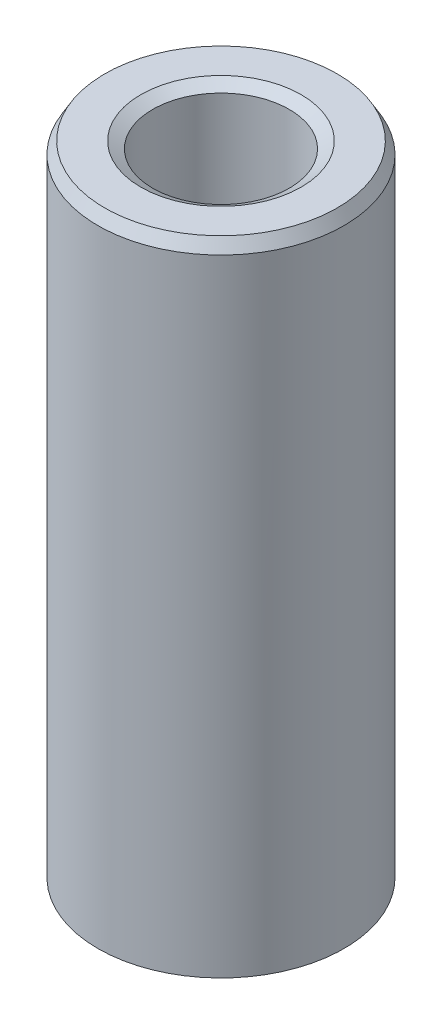
ISO-10303-21;
HEADER;
FILE_DESCRIPTION(('STEP AP214'),'2;1');
FILE_NAME('part.step','',(''),(''),'','','');
FILE_SCHEMA(('AUTOMOTIVE_DESIGN { 1 0 10303 214 1 1 1 1 }'));
ENDSEC;
DATA;
#1=APPLICATION_CONTEXT('core data for automotive mechanical design processes');
#2=APPLICATION_PROTOCOL_DEFINITION('international standard','automotive_design',2000,#1);
#3=PRODUCT_CONTEXT('',#1,'mechanical');
#4=PRODUCT('Part','Part','',(#3));
#5=PRODUCT_RELATED_PRODUCT_CATEGORY('part','',(#4));
#6=PRODUCT_DEFINITION_FORMATION('','',#4);
#7=PRODUCT_DEFINITION_CONTEXT('part definition',#1,'design');
#8=PRODUCT_DEFINITION('design','',#6,#7);
#9=PRODUCT_DEFINITION_SHAPE('','',#8);
#10=(LENGTH_UNIT() NAMED_UNIT(*) SI_UNIT(.MILLI.,.METRE.));
#11=(NAMED_UNIT(*) PLANE_ANGLE_UNIT() SI_UNIT($,.RADIAN.));
#12=(NAMED_UNIT(*) SI_UNIT($,.STERADIAN.) SOLID_ANGLE_UNIT());
#13=UNCERTAINTY_MEASURE_WITH_UNIT(LENGTH_MEASURE(1.E-05),#10,'distance_accuracy_value','');
#14=(GEOMETRIC_REPRESENTATION_CONTEXT(3) GLOBAL_UNCERTAINTY_ASSIGNED_CONTEXT((#13)) GLOBAL_UNIT_ASSIGNED_CONTEXT((#10,
#11,#12)) REPRESENTATION_CONTEXT('',''));
#15=CARTESIAN_POINT('',(0.,0.,0.));
#16=DIRECTION('',(0.,0.,1.));
#17=DIRECTION('',(1.,0.,0.));
#18=AXIS2_PLACEMENT_3D('',#15,#16,#17);
#19=CARTESIAN_POINT('',(0.,39.2922602206533,0.));
#20=DIRECTION('',(0.,-1.,0.));
#21=DIRECTION('',(0.,0.,-1.));
#22=AXIS2_PLACEMENT_3D('',#19,#20,#21);
#23=CYLINDRICAL_SURFACE('',#22,7.5);
#24=CARTESIAN_POINT('',(0.,0.417417148929108,0.));
#25=DIRECTION('',(0.,1.,0.));
#26=DIRECTION('',(0.,0.,1.));
#27=AXIS2_PLACEMENT_3D('',#24,#25,#26);
#28=CIRCLE('',#27,7.5);
#29=CARTESIAN_POINT('',(0.,0.417417148929108,-7.5));
#30=VERTEX_POINT('',#29);
#31=EDGE_CURVE('E10',#30,#30,#28,.T.);
#32=CARTESIAN_POINT('',(0.,38.5692725107575,0.));
#33=DIRECTION('',(0.,1.,0.));
#34=DIRECTION('',(0.,0.,1.));
#35=AXIS2_PLACEMENT_3D('',#32,#33,#34);
#36=CIRCLE('',#35,7.5);
#37=CARTESIAN_POINT('',(0.,38.5692725107575,-7.5));
#38=VERTEX_POINT('',#37);
#39=EDGE_CURVE('E50',#38,#38,#36,.F.);
#40=CARTESIAN_POINT('',(0.,0.417417148929108,-7.5));
#41=CARTESIAN_POINT('',(0.,0.814832308948156,-7.5));
#42=CARTESIAN_POINT('',(0.,1.2122474689672,-7.5));
#43=CARTESIAN_POINT('',(0.,2.00707778900529,-7.5));
#44=CARTESIAN_POINT('',(0.,2.40449294902434,-7.5));
#45=CARTESIAN_POINT('',(0.,3.19932326906243,-7.5));
#46=CARTESIAN_POINT('',(0.,3.59673842908147,-7.5));
#47=CARTESIAN_POINT('',(0.,4.39156874911957,-7.5));
#48=CARTESIAN_POINT('',(0.,4.78898390913861,-7.5));
#49=CARTESIAN_POINT('',(0.,5.58381422917671,-7.5));
#50=CARTESIAN_POINT('',(0.,5.98122938919575,-7.5));
#51=CARTESIAN_POINT('',(0.,6.77605970923385,-7.5));
#52=CARTESIAN_POINT('',(0.,7.17347486925289,-7.5));
#53=CARTESIAN_POINT('',(0.,7.96830518929098,-7.5));
#54=CARTESIAN_POINT('',(0.,8.36572034931003,-7.5));
#55=CARTESIAN_POINT('',(0.,9.16055066934812,-7.5));
#56=CARTESIAN_POINT('',(0.,9.55796582936716,-7.5));
#57=CARTESIAN_POINT('',(0.,10.3527961494053,-7.5));
#58=CARTESIAN_POINT('',(0.,10.7502113094243,-7.5));
#59=CARTESIAN_POINT('',(0.,11.5450416294624,-7.5));
#60=CARTESIAN_POINT('',(0.,11.9424567894814,-7.5));
#61=CARTESIAN_POINT('',(0.,12.7372871095195,-7.5));
#62=CARTESIAN_POINT('',(0.,13.1347022695386,-7.5));
#63=CARTESIAN_POINT('',(0.,13.9295325895767,-7.5));
#64=CARTESIAN_POINT('',(0.,14.3269477495957,-7.5));
#65=CARTESIAN_POINT('',(0.,15.1217780696338,-7.5));
#66=CARTESIAN_POINT('',(0.,15.5191932296529,-7.5));
#67=CARTESIAN_POINT('',(0.,16.3140235496909,-7.5));
#68=CARTESIAN_POINT('',(0.,16.71143870971,-7.5));
#69=CARTESIAN_POINT('',(0.,17.5062690297481,-7.5));
#70=CARTESIAN_POINT('',(0.,17.9036841897671,-7.5));
#71=CARTESIAN_POINT('',(0.,18.6985145098052,-7.5));
#72=CARTESIAN_POINT('',(0.,19.0959296698243,-7.5));
#73=CARTESIAN_POINT('',(0.,19.8907599898624,-7.5));
#74=CARTESIAN_POINT('',(0.,20.2881751498814,-7.5));
#75=CARTESIAN_POINT('',(0.,21.0830054699195,-7.5));
#76=CARTESIAN_POINT('',(0.,21.4804206299385,-7.5));
#77=CARTESIAN_POINT('',(0.,22.2752509499766,-7.5));
#78=CARTESIAN_POINT('',(0.,22.6726661099957,-7.5));
#79=CARTESIAN_POINT('',(0.,23.4674964300338,-7.5));
#80=CARTESIAN_POINT('',(0.,23.8649115900528,-7.5));
#81=CARTESIAN_POINT('',(0.,24.6597419100909,-7.5));
#82=CARTESIAN_POINT('',(0.,25.05715707011,-7.5));
#83=CARTESIAN_POINT('',(0.,25.8519873901481,-7.5));
#84=CARTESIAN_POINT('',(0.,26.2494025501671,-7.5));
#85=CARTESIAN_POINT('',(0.,27.0442328702052,-7.5));
#86=CARTESIAN_POINT('',(0.,27.4416480302242,-7.5));
#87=CARTESIAN_POINT('',(0.,28.2364783502623,-7.5));
#88=CARTESIAN_POINT('',(0.,28.6338935102814,-7.5));
#89=CARTESIAN_POINT('',(0.,29.4287238303195,-7.5));
#90=CARTESIAN_POINT('',(0.,29.8261389903385,-7.5));
#91=CARTESIAN_POINT('',(0.,30.6209693103766,-7.5));
#92=CARTESIAN_POINT('',(0.,31.0183844703956,-7.5));
#93=CARTESIAN_POINT('',(0.,31.8132147904337,-7.5));
#94=CARTESIAN_POINT('',(0.,32.2106299504528,-7.5));
#95=CARTESIAN_POINT('',(0.,33.0054602704909,-7.5));
#96=CARTESIAN_POINT('',(0.,33.4028754305099,-7.5));
#97=CARTESIAN_POINT('',(0.,34.197705750548,-7.5));
#98=CARTESIAN_POINT('',(0.,34.5951209105671,-7.5));
#99=CARTESIAN_POINT('',(0.,35.3899512306052,-7.5));
#100=CARTESIAN_POINT('',(0.,35.7873663906242,-7.5));
#101=CARTESIAN_POINT('',(0.,36.5821967106623,-7.5));
#102=CARTESIAN_POINT('',(0.,36.9796118706813,-7.5));
#103=CARTESIAN_POINT('',(0.,37.7744421907194,-7.5));
#104=CARTESIAN_POINT('',(0.,38.1718573507385,-7.5));
#105=CARTESIAN_POINT('',(0.,38.5692725107575,-7.5));
#106=B_SPLINE_CURVE_WITH_KNOTS('',3,(#40,#41,#42,#43,#44,#45,#46,#47,#48,#49,#50,#51,#52,#53,
#54,#55,#56,#57,#58,#59,#60,#61,#62,#63,#64,#65,#66,#67,#68,#69,#70,#71,#72,#73,#74,#75,#76,#77,
#78,#79,#80,#81,#82,#83,#84,#85,#86,#87,#88,#89,#90,#91,#92,#93,#94,#95,#96,#97,#98,#99,#100,
#101,#102,#103,#104,#105),.UNSPECIFIED.,.F.,.F.,(4,2,2,2,2,2,2,2,2,2,2,2,2,2,2,2,2,2,2,2,2,2,2,
2,2,2,2,2,2,2,2,2,4),(0.,1.19224548005714,2.38449096011428,3.57673644017141,4.76898192022855,
5.96122740028569,7.15347288034283,8.34571836039997,9.5379638404571,10.7302093205142,
11.9224548005714,13.1147002806285,14.3069457606857,15.4991912407428,16.6914367207999,
17.8836822008571,19.0759276809142,20.2681731609713,21.4604186410285,22.6526641210856,
23.8449096011428,25.0371550811999,26.229400561257,27.4216460413142,28.6138915213713,
29.8061370014284,30.9983824814856,32.1906279615427,33.3828734415999,34.575118921657,
35.7673644017141,36.9596098817713,38.1518553618284),.UNSPECIFIED.);
#107=EDGE_CURVE('BSEAM39',#30,#38,#106,.T.);
#108=ORIENTED_EDGE('',*,*,#31,.T.);
#109=ORIENTED_EDGE('',*,*,#39,.T.);
#110=ORIENTED_EDGE('',*,*,#107,.T.);
#111=ORIENTED_EDGE('',*,*,#107,.F.);
#112=EDGE_LOOP('',(#108,#110,#109,#111));
#113=FACE_BOUND('',#112,.T.);
#114=ADVANCED_FACE('F39',(#113),#23,.T.);
#115=CARTESIAN_POINT('',(0.,39.2922602206533,0.));
#116=DIRECTION('',(0.,1.,0.));
#117=DIRECTION('',(0.,0.,1.));
#118=AXIS2_PLACEMENT_3D('',#115,#116,#117);
#119=PLANE('',#118);
#120=CARTESIAN_POINT('',(0.,39.2922602206533,0.));
#121=DIRECTION('',(0.,1.,0.));
#122=DIRECTION('',(0.,0.,1.));
#123=AXIS2_PLACEMENT_3D('',#120,#121,#122);
#124=CIRCLE('',#123,4.88631858253508);
#125=CARTESIAN_POINT('',(0.,39.2922602206533,4.88631858253508));
#126=VERTEX_POINT('',#125);
#127=EDGE_CURVE('E58',#126,#126,#124,.F.);
#128=ORIENTED_EDGE('',*,*,#127,.T.);
#129=EDGE_LOOP('',(#128));
#130=FACE_BOUND('',#129,.T.);
#131=CARTESIAN_POINT('',(0.,39.2922602206533,0.));
#132=DIRECTION('',(0.,1.,0.));
#133=DIRECTION('',(0.,0.,1.));
#134=AXIS2_PLACEMENT_3D('',#131,#132,#133);
#135=CIRCLE('',#134,7.0825828510709);
#136=CARTESIAN_POINT('',(0.,39.2922602206533,-7.0825828510709));
#137=VERTEX_POINT('',#136);
#138=EDGE_CURVE('E61',#137,#137,#135,.T.);
#139=ORIENTED_EDGE('',*,*,#138,.T.);
#140=EDGE_LOOP('',(#139));
#141=FACE_BOUND('',#140,.T.);
#142=ADVANCED_FACE('F88',(#130,#141),#119,.T.);
#143=CARTESIAN_POINT('',(0.,0.,0.));
#144=DIRECTION('',(0.,1.,0.));
#145=DIRECTION('',(0.,0.,1.));
#146=AXIS2_PLACEMENT_3D('',#143,#144,#145);
#147=PLANE('',#146);
#148=CARTESIAN_POINT('',(0.,0.,0.));
#149=DIRECTION('',(0.,1.,0.));
#150=DIRECTION('',(0.,0.,1.));
#151=AXIS2_PLACEMENT_3D('',#148,#149,#150);
#152=CIRCLE('',#151,4.58074802156842);
#153=CARTESIAN_POINT('',(0.,0.,4.58074802156842));
#154=VERTEX_POINT('',#153);
#155=EDGE_CURVE('E51',#154,#154,#152,.T.);
#156=ORIENTED_EDGE('',*,*,#155,.T.);
#157=EDGE_LOOP('',(#156));
#158=FACE_BOUND('',#157,.T.);
#159=CARTESIAN_POINT('',(0.,0.,0.));
#160=DIRECTION('',(0.,1.,0.));
#161=DIRECTION('',(0.,0.,1.));
#162=AXIS2_PLACEMENT_3D('',#159,#160,#161);
#163=CIRCLE('',#162,6.77701229010423);
#164=CARTESIAN_POINT('',(0.,0.,6.77701229010423));
#165=VERTEX_POINT('',#164);
#166=EDGE_CURVE('E54',#165,#165,#163,.F.);
#167=ORIENTED_EDGE('',*,*,#166,.T.);
#168=EDGE_LOOP('',(#167));
#169=FACE_BOUND('',#168,.T.);
#170=ADVANCED_FACE('F83',(#158,#169),#147,.F.);
#171=CARTESIAN_POINT('',(0.,39.2922602206533,0.));
#172=DIRECTION('',(0.,-1.,0.));
#173=DIRECTION('',(0.,0.,-1.));
#174=AXIS2_PLACEMENT_3D('',#171,#172,#173);
#175=CYLINDRICAL_SURFACE('',#174,4.16333087263931);
#176=CARTESIAN_POINT('',(0.,38.8748430717242,0.));
#177=DIRECTION('',(0.,1.,0.));
#178=DIRECTION('',(0.,0.,1.));
#179=AXIS2_PLACEMENT_3D('',#176,#177,#178);
#180=CIRCLE('',#179,4.16333087263931);
#181=CARTESIAN_POINT('',(0.,38.8748430717242,4.16333087263931));
#182=VERTEX_POINT('',#181);
#183=EDGE_CURVE('E67',#182,#182,#180,.T.);
#184=ORIENTED_EDGE('',*,*,#183,.T.);
#185=EDGE_LOOP('',(#184));
#186=FACE_BOUND('',#185,.T.);
#187=CARTESIAN_POINT('',(0.,0.722987709895768,0.));
#188=DIRECTION('',(0.,1.,0.));
#189=DIRECTION('',(0.,0.,1.));
#190=AXIS2_PLACEMENT_3D('',#187,#188,#189);
#191=CIRCLE('',#190,4.16333087263931);
#192=CARTESIAN_POINT('',(0.,0.722987709895768,4.16333087263931));
#193=VERTEX_POINT('',#192);
#194=EDGE_CURVE('E69',#193,#193,#191,.F.);
#195=ORIENTED_EDGE('',*,*,#194,.T.);
#196=EDGE_LOOP('',(#195));
#197=FACE_BOUND('',#196,.T.);
#198=ADVANCED_FACE('F71',(#186,#197),#175,.F.);
#199=CARTESIAN_POINT('',(0.,38.8748430717242,0.));
#200=DIRECTION('',(0.,1.,0.));
#201=DIRECTION('',(0.,0.,1.));
#202=AXIS2_PLACEMENT_3D('',#199,#200,#201);
#203=CONICAL_SURFACE('',#202,4.16333087263931,1.04719755119659);
#204=ORIENTED_EDGE('',*,*,#127,.F.);
#205=EDGE_LOOP('',(#204));
#206=FACE_BOUND('',#205,.T.);
#207=ORIENTED_EDGE('',*,*,#183,.F.);
#208=EDGE_LOOP('',(#207));
#209=FACE_BOUND('',#208,.T.);
#210=ADVANCED_FACE('F77',(#206,#209),#203,.F.);
#211=CARTESIAN_POINT('',(0.,0.,0.));
#212=DIRECTION('',(0.,-1.,0.));
#213=DIRECTION('',(0.,0.,-1.));
#214=AXIS2_PLACEMENT_3D('',#211,#212,#213);
#215=CONICAL_SURFACE('',#214,4.58074802156842,0.523598775598296);
#216=ORIENTED_EDGE('',*,*,#194,.F.);
#217=EDGE_LOOP('',(#216));
#218=FACE_BOUND('',#217,.T.);
#219=ORIENTED_EDGE('',*,*,#155,.F.);
#220=EDGE_LOOP('',(#219));
#221=FACE_BOUND('',#220,.T.);
#222=ADVANCED_FACE('F73',(#218,#221),#215,.F.);
#223=CARTESIAN_POINT('',(0.,0.417417148929108,0.));
#224=DIRECTION('',(0.,1.,0.));
#225=DIRECTION('',(0.,0.,1.));
#226=AXIS2_PLACEMENT_3D('',#223,#224,#225);
#227=CONICAL_SURFACE('',#226,7.5,1.0471975511966);
#228=ORIENTED_EDGE('',*,*,#166,.F.);
#229=EDGE_LOOP('',(#228));
#230=FACE_BOUND('',#229,.T.);
#231=ORIENTED_EDGE('',*,*,#31,.F.);
#232=EDGE_LOOP('',(#231));
#233=FACE_BOUND('',#232,.T.);
#234=ADVANCED_FACE('F76',(#230,#233),#227,.T.);
#235=CARTESIAN_POINT('',(0.,39.2922602206533,0.));
#236=DIRECTION('',(0.,-1.,0.));
#237=DIRECTION('',(0.,0.,-1.));
#238=AXIS2_PLACEMENT_3D('',#235,#236,#237);
#239=CONICAL_SURFACE('',#238,7.0825828510709,0.523598775598295);
#240=CARTESIAN_POINT('',(0.,38.5692725107575,-7.5));
#241=CARTESIAN_POINT('',(0.,38.5768036327356,-7.49565190469866));
#242=CARTESIAN_POINT('',(0.,38.5843347547137,-7.49130380939731));
#243=CARTESIAN_POINT('',(0.,38.5993969986698,-7.48260761879462));
#244=CARTESIAN_POINT('',(0.,38.6069281206479,-7.47825952349328));
#245=CARTESIAN_POINT('',(0.,38.6219903646041,-7.46956333289059));
#246=CARTESIAN_POINT('',(0.,38.6295214865822,-7.46521523758924));
#247=CARTESIAN_POINT('',(0.,38.6445837305383,-7.45651904698655));
#248=CARTESIAN_POINT('',(0.,38.6521148525164,-7.45217095168521));
#249=CARTESIAN_POINT('',(0.,38.6671770964726,-7.44347476108252));
#250=CARTESIAN_POINT('',(0.,38.6747082184507,-7.43912666578117));
#251=CARTESIAN_POINT('',(0.,38.6897704624068,-7.43043047517849));
#252=CARTESIAN_POINT('',(0.,38.6973015843849,-7.42608237987714));
#253=CARTESIAN_POINT('',(0.,38.7123638283411,-7.41738618927445));
#254=CARTESIAN_POINT('',(0.,38.7198949503191,-7.41303809397311));
#255=CARTESIAN_POINT('',(0.,38.7349571942753,-7.40434190337042));
#256=CARTESIAN_POINT('',(0.,38.7424883162534,-7.39999380806907));
#257=CARTESIAN_POINT('',(0.,38.7575505602095,-7.39129761746638));
#258=CARTESIAN_POINT('',(0.,38.7650816821876,-7.38694952216504));
#259=CARTESIAN_POINT('',(0.,38.7801439261438,-7.37825333156235));
#260=CARTESIAN_POINT('',(0.,38.7876750481219,-7.373905236261));
#261=CARTESIAN_POINT('',(0.,38.802737292078,-7.36520904565831));
#262=CARTESIAN_POINT('',(0.,38.8102684140561,-7.36086095035697));
#263=CARTESIAN_POINT('',(0.,38.8253306580123,-7.35216475975428));
#264=CARTESIAN_POINT('',(0.,38.8328617799904,-7.34781666445293));
#265=CARTESIAN_POINT('',(0.,38.8479240239465,-7.33912047385024));
#266=CARTESIAN_POINT('',(0.,38.8554551459246,-7.3347723785489));
#267=CARTESIAN_POINT('',(0.,38.8705173898808,-7.32607618794621));
#268=CARTESIAN_POINT('',(0.,38.8780485118588,-7.32172809264486));
#269=CARTESIAN_POINT('',(0.,38.893110755815,-7.31303190204218));
#270=CARTESIAN_POINT('',(0.,38.9006418777931,-7.30868380674083));
#271=CARTESIAN_POINT('',(0.,38.9157041217492,-7.29998761613814));
#272=CARTESIAN_POINT('',(0.,38.9232352437273,-7.2956395208368));
#273=CARTESIAN_POINT('',(0.,38.9382974876835,-7.28694333023411));
#274=CARTESIAN_POINT('',(0.,38.9458286096616,-7.28259523493276));
#275=CARTESIAN_POINT('',(0.,38.9608908536177,-7.27389904433007));
#276=CARTESIAN_POINT('',(0.,38.9684219755958,-7.26955094902873));
#277=CARTESIAN_POINT('',(0.,38.983484219552,-7.26085475842604));
#278=CARTESIAN_POINT('',(0.,38.9910153415301,-7.25650666312469));
#279=CARTESIAN_POINT('',(0.,39.0060775854862,-7.247810472522));
#280=CARTESIAN_POINT('',(0.,39.0136087074643,-7.24346237722066));
#281=CARTESIAN_POINT('',(0.,39.0286709514205,-7.23476618661797));
#282=CARTESIAN_POINT('',(0.,39.0362020733985,-7.23041809131662));
#283=CARTESIAN_POINT('',(0.,39.0512643173547,-7.22172190071393));
#284=CARTESIAN_POINT('',(0.,39.0587954393328,-7.21737380541259));
#285=CARTESIAN_POINT('',(0.,39.0738576832889,-7.2086776148099));
#286=CARTESIAN_POINT('',(0.,39.081388805267,-7.20432951950855));
#287=CARTESIAN_POINT('',(0.,39.0964510492232,-7.19563332890587));
#288=CARTESIAN_POINT('',(0.,39.1039821712013,-7.19128523360452));
#289=CARTESIAN_POINT('',(0.,39.1190444151574,-7.18258904300183));
#290=CARTESIAN_POINT('',(0.,39.1265755371355,-7.17824094770049));
#291=CARTESIAN_POINT('',(0.,39.1416377810917,-7.1695447570978));
#292=CARTESIAN_POINT('',(0.,39.1491689030698,-7.16519666179645));
#293=CARTESIAN_POINT('',(0.,39.1642311470259,-7.15650047119376));
#294=CARTESIAN_POINT('',(0.,39.171762269004,-7.15215237589242));
#295=CARTESIAN_POINT('',(0.,39.1868245129602,-7.14345618528973));
#296=CARTESIAN_POINT('',(0.,39.1943556349382,-7.13910808998838));
#297=CARTESIAN_POINT('',(0.,39.2094178788944,-7.13041189938569));
#298=CARTESIAN_POINT('',(0.,39.2169490008725,-7.12606380408435));
#299=CARTESIAN_POINT('',(0.,39.2320112448286,-7.11736761348166));
#300=CARTESIAN_POINT('',(0.,39.2395423668067,-7.11301951818031));
#301=CARTESIAN_POINT('',(0.,39.2546046107629,-7.10432332757762));
#302=CARTESIAN_POINT('',(0.,39.262135732741,-7.09997523227628));
#303=CARTESIAN_POINT('',(0.,39.2771979766971,-7.09127904167359));
#304=CARTESIAN_POINT('',(0.,39.2847290986752,-7.08693094637225));
#305=CARTESIAN_POINT('',(0.,39.2922602206533,-7.0825828510709));
#306=B_SPLINE_CURVE_WITH_KNOTS('',3,(#240,#241,#242,#243,#244,#245,#246,#247,#248,#249,#250,
#251,#252,#253,#254,#255,#256,#257,#258,#259,#260,#261,#262,#263,#264,#265,#266,#267,#268,#269,
#270,#271,#272,#273,#274,#275,#276,#277,#278,#279,#280,#281,#282,#283,#284,#285,#286,#287,#288,
#289,#290,#291,#292,#293,#294,#295,#296,#297,#298,#299,#300,#301,#302,#303,#304,#305),
.UNSPECIFIED.,.F.,.F.,(4,2,2,2,2,2,2,2,2,2,2,2,2,2,2,2,2,2,2,2,2,2,2,2,2,2,2,2,2,2,2,2,4),(0.,
0.0260885718080631,0.0521771436161322,0.0782657154242012,0.104354287232271,0.13044285904034,
0.156531430848409,0.182620002656478,0.208708574464548,0.234797146272617,0.260885718080686,
0.286974289888755,0.313062861696824,0.339151433504893,0.365240005312962,0.391328577121031,
0.417417148929101,0.44350572073717,0.469594292545239,0.495682864353308,0.521771436161378,
0.547860007969447,0.573948579777516,0.600037151585585,0.626125723393654,0.652214295201723,
0.678302867009792,0.704391438817861,0.730480010625931,0.756568582434,0.782657154242069,
0.808745726050138,0.834834297858208),.UNSPECIFIED.);
#307=EDGE_CURVE('BSEAM45',#38,#137,#306,.T.);
#308=ORIENTED_EDGE('',*,*,#39,.F.);
#309=ORIENTED_EDGE('',*,*,#138,.F.);
#310=ORIENTED_EDGE('',*,*,#307,.T.);
#311=ORIENTED_EDGE('',*,*,#307,.F.);
#312=EDGE_LOOP('',(#308,#310,#309,#311));
#313=FACE_BOUND('',#312,.T.);
#314=ADVANCED_FACE('F45',(#313),#239,.T.);
#315=CLOSED_SHELL('',(#114,#142,#170,#198,#210,#222,#234,#314));
#316=MANIFOLD_SOLID_BREP('B2',#315);
#317=ADVANCED_BREP_SHAPE_REPRESENTATION('',(#18,#316),#14);
#318=SHAPE_DEFINITION_REPRESENTATION(#9,#317);
ENDSEC;
END-ISO-10303-21;
